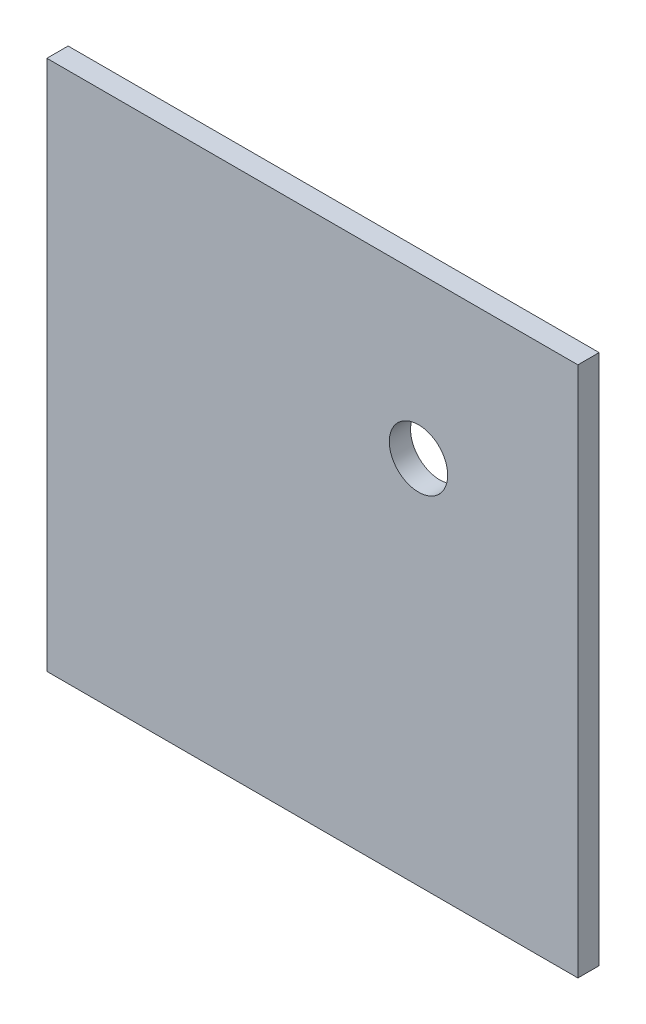
ISO-10303-21;
HEADER;
FILE_DESCRIPTION(('STEP AP214'),'2;1');
FILE_NAME('part.step','',(''),(''),'','','');
FILE_SCHEMA(('AUTOMOTIVE_DESIGN { 1 0 10303 214 1 1 1 1 }'));
ENDSEC;
DATA;
#1=APPLICATION_CONTEXT('core data for automotive mechanical design processes');
#2=APPLICATION_PROTOCOL_DEFINITION('international standard','automotive_design',2000,#1);
#3=PRODUCT_CONTEXT('',#1,'mechanical');
#4=PRODUCT('Part','Part','',(#3));
#5=PRODUCT_RELATED_PRODUCT_CATEGORY('part','',(#4));
#6=PRODUCT_DEFINITION_FORMATION('','',#4);
#7=PRODUCT_DEFINITION_CONTEXT('part definition',#1,'design');
#8=PRODUCT_DEFINITION('design','',#6,#7);
#9=PRODUCT_DEFINITION_SHAPE('','',#8);
#10=(LENGTH_UNIT() NAMED_UNIT(*) SI_UNIT(.MILLI.,.METRE.));
#11=(NAMED_UNIT(*) PLANE_ANGLE_UNIT() SI_UNIT($,.RADIAN.));
#12=(NAMED_UNIT(*) SI_UNIT($,.STERADIAN.) SOLID_ANGLE_UNIT());
#13=UNCERTAINTY_MEASURE_WITH_UNIT(LENGTH_MEASURE(1.E-05),#10,'distance_accuracy_value','');
#14=(GEOMETRIC_REPRESENTATION_CONTEXT(3) GLOBAL_UNCERTAINTY_ASSIGNED_CONTEXT((#13)) GLOBAL_UNIT_ASSIGNED_CONTEXT((#10,
#11,#12)) REPRESENTATION_CONTEXT('',''));
#15=CARTESIAN_POINT('',(0.,0.,0.));
#16=DIRECTION('',(0.,0.,1.));
#17=DIRECTION('',(1.,0.,0.));
#18=AXIS2_PLACEMENT_3D('',#15,#16,#17);
#19=CARTESIAN_POINT('',(50.,-50.,4.));
#20=DIRECTION('',(-1.,0.,0.));
#21=DIRECTION('',(0.,0.,1.));
#22=AXIS2_PLACEMENT_3D('',#19,#20,#21);
#23=PLANE('',#22);
#24=DIRECTION('',(0.,1.,0.));
#25=VECTOR('',#24,1.);
#26=CARTESIAN_POINT('',(50.,-50.,0.));
#27=LINE('',#26,#25);
#28=CARTESIAN_POINT('',(50.,-50.,0.));
#29=VERTEX_POINT('',#28);
#30=CARTESIAN_POINT('',(50.,50.,0.));
#31=VERTEX_POINT('',#30);
#32=EDGE_CURVE('E97',#29,#31,#27,.T.);
#33=ORIENTED_EDGE('',*,*,#32,.T.);
#34=DIRECTION('',(0.,0.,-1.));
#35=VECTOR('',#34,1.);
#36=CARTESIAN_POINT('',(50.,50.,4.));
#37=LINE('',#36,#35);
#38=CARTESIAN_POINT('',(50.,50.,4.));
#39=VERTEX_POINT('',#38);
#40=EDGE_CURVE('E11',#39,#31,#37,.T.);
#41=ORIENTED_EDGE('',*,*,#40,.F.);
#42=DIRECTION('',(0.,1.,0.));
#43=VECTOR('',#42,1.);
#44=CARTESIAN_POINT('',(50.,-50.,4.));
#45=LINE('',#44,#43);
#46=CARTESIAN_POINT('',(50.,-50.,4.));
#47=VERTEX_POINT('',#46);
#48=EDGE_CURVE('E85',#47,#39,#45,.T.);
#49=ORIENTED_EDGE('',*,*,#48,.F.);
#50=DIRECTION('',(0.,0.,-1.));
#51=VECTOR('',#50,1.);
#52=CARTESIAN_POINT('',(50.,-50.,4.));
#53=LINE('',#52,#51);
#54=EDGE_CURVE('E93',#47,#29,#53,.T.);
#55=ORIENTED_EDGE('',*,*,#54,.T.);
#56=EDGE_LOOP('',(#33,#41,#49,#55));
#57=FACE_BOUND('',#56,.T.);
#58=ADVANCED_FACE('F34',(#57),#23,.F.);
#59=CARTESIAN_POINT('',(-50.,50.,4.));
#60=DIRECTION('',(0.,-1.,0.));
#61=DIRECTION('',(0.,0.,-1.));
#62=AXIS2_PLACEMENT_3D('',#59,#60,#61);
#63=PLANE('',#62);
#64=DIRECTION('',(-1.,0.,0.));
#65=VECTOR('',#64,1.);
#66=CARTESIAN_POINT('',(-50.,50.,0.));
#67=LINE('',#66,#65);
#68=CARTESIAN_POINT('',(-50.,50.,0.));
#69=VERTEX_POINT('',#68);
#70=EDGE_CURVE('E89',#31,#69,#67,.T.);
#71=ORIENTED_EDGE('',*,*,#70,.T.);
#72=DIRECTION('',(0.,0.,-1.));
#73=VECTOR('',#72,1.);
#74=CARTESIAN_POINT('',(-50.,50.,4.));
#75=LINE('',#74,#73);
#76=CARTESIAN_POINT('',(-50.,50.,4.));
#77=VERTEX_POINT('',#76);
#78=EDGE_CURVE('E42',#77,#69,#75,.T.);
#79=ORIENTED_EDGE('',*,*,#78,.F.);
#80=DIRECTION('',(-1.,0.,0.));
#81=VECTOR('',#80,1.);
#82=CARTESIAN_POINT('',(-50.,50.,4.));
#83=LINE('',#82,#81);
#84=EDGE_CURVE('E80',#39,#77,#83,.T.);
#85=ORIENTED_EDGE('',*,*,#84,.F.);
#86=ORIENTED_EDGE('',*,*,#40,.T.);
#87=EDGE_LOOP('',(#71,#79,#85,#86));
#88=FACE_BOUND('',#87,.T.);
#89=ADVANCED_FACE('F88',(#88),#63,.F.);
#90=CARTESIAN_POINT('',(-50.,-50.,4.));
#91=DIRECTION('',(1.,0.,0.));
#92=DIRECTION('',(0.,0.,-1.));
#93=AXIS2_PLACEMENT_3D('',#90,#91,#92);
#94=PLANE('',#93);
#95=DIRECTION('',(0.,-1.,0.));
#96=VECTOR('',#95,1.);
#97=CARTESIAN_POINT('',(-50.,-50.,0.));
#98=LINE('',#97,#96);
#99=CARTESIAN_POINT('',(-50.,-50.,0.));
#100=VERTEX_POINT('',#99);
#101=EDGE_CURVE('E67',#69,#100,#98,.T.);
#102=ORIENTED_EDGE('',*,*,#101,.T.);
#103=DIRECTION('',(0.,0.,-1.));
#104=VECTOR('',#103,1.);
#105=CARTESIAN_POINT('',(-50.,-50.,4.));
#106=LINE('',#105,#104);
#107=CARTESIAN_POINT('',(-50.,-50.,4.));
#108=VERTEX_POINT('',#107);
#109=EDGE_CURVE('E90',#108,#100,#106,.T.);
#110=ORIENTED_EDGE('',*,*,#109,.F.);
#111=DIRECTION('',(0.,-1.,0.));
#112=VECTOR('',#111,1.);
#113=CARTESIAN_POINT('',(-50.,-50.,4.));
#114=LINE('',#113,#112);
#115=EDGE_CURVE('E83',#77,#108,#114,.T.);
#116=ORIENTED_EDGE('',*,*,#115,.F.);
#117=ORIENTED_EDGE('',*,*,#78,.T.);
#118=EDGE_LOOP('',(#102,#110,#116,#117));
#119=FACE_BOUND('',#118,.T.);
#120=ADVANCED_FACE('F91',(#119),#94,.F.);
#121=CARTESIAN_POINT('',(-50.,-50.,4.));
#122=DIRECTION('',(0.,1.,0.));
#123=DIRECTION('',(0.,0.,1.));
#124=AXIS2_PLACEMENT_3D('',#121,#122,#123);
#125=PLANE('',#124);
#126=DIRECTION('',(1.,0.,0.));
#127=VECTOR('',#126,1.);
#128=CARTESIAN_POINT('',(-50.,-50.,0.));
#129=LINE('',#128,#127);
#130=EDGE_CURVE('E73',#100,#29,#129,.T.);
#131=ORIENTED_EDGE('',*,*,#130,.T.);
#132=ORIENTED_EDGE('',*,*,#54,.F.);
#133=DIRECTION('',(1.,0.,0.));
#134=VECTOR('',#133,1.);
#135=CARTESIAN_POINT('',(-50.,-50.,4.));
#136=LINE('',#135,#134);
#137=EDGE_CURVE('E50',#108,#47,#136,.T.);
#138=ORIENTED_EDGE('',*,*,#137,.F.);
#139=ORIENTED_EDGE('',*,*,#109,.T.);
#140=EDGE_LOOP('',(#131,#132,#138,#139));
#141=FACE_BOUND('',#140,.T.);
#142=ADVANCED_FACE('F105',(#141),#125,.F.);
#143=CARTESIAN_POINT('',(0.,0.,4.));
#144=DIRECTION('',(0.,0.,-1.));
#145=DIRECTION('',(-1.,0.,0.));
#146=AXIS2_PLACEMENT_3D('',#143,#144,#145);
#147=PLANE('',#146);
#148=CARTESIAN_POINT('',(19.9832422219013,19.7310085100067,4.));
#149=DIRECTION('',(0.,0.,1.));
#150=DIRECTION('',(1.,0.,0.));
#151=AXIS2_PLACEMENT_3D('',#148,#149,#150);
#152=CIRCLE('',#151,5.5);
#153=CARTESIAN_POINT('',(25.4832422219013,19.7310085100067,4.));
#154=VERTEX_POINT('',#153);
#155=EDGE_CURVE('E135',#154,#154,#152,.T.);
#156=ORIENTED_EDGE('',*,*,#155,.F.);
#157=EDGE_LOOP('',(#156));
#158=FACE_BOUND('',#157,.T.);
#159=ORIENTED_EDGE('',*,*,#48,.T.);
#160=ORIENTED_EDGE('',*,*,#84,.T.);
#161=ORIENTED_EDGE('',*,*,#115,.T.);
#162=ORIENTED_EDGE('',*,*,#137,.T.);
#163=EDGE_LOOP('',(#159,#160,#161,#162));
#164=FACE_BOUND('',#163,.T.);
#165=ADVANCED_FACE('F81',(#158,#164),#147,.F.);
#166=CARTESIAN_POINT('',(0.,0.,0.));
#167=DIRECTION('',(0.,0.,-1.));
#168=DIRECTION('',(-1.,0.,0.));
#169=AXIS2_PLACEMENT_3D('',#166,#167,#168);
#170=PLANE('',#169);
#171=CARTESIAN_POINT('',(19.9832422219013,19.7310085100067,0.));
#172=DIRECTION('',(0.,0.,1.));
#173=DIRECTION('',(1.,0.,0.));
#174=AXIS2_PLACEMENT_3D('',#171,#172,#173);
#175=CIRCLE('',#174,5.5);
#176=CARTESIAN_POINT('',(25.4832422219013,19.7310085100067,0.));
#177=VERTEX_POINT('',#176);
#178=EDGE_CURVE('E121',#177,#177,#175,.T.);
#179=ORIENTED_EDGE('',*,*,#178,.T.);
#180=EDGE_LOOP('',(#179));
#181=FACE_BOUND('',#180,.T.);
#182=CARTESIAN_POINT('',(-45.,-45.,0.));
#183=DIRECTION('',(0.,0.,-1.));
#184=DIRECTION('',(-1.,0.,0.));
#185=AXIS2_PLACEMENT_3D('',#182,#183,#184);
#186=CIRCLE('',#185,4.75);
#187=CARTESIAN_POINT('',(-49.75,-45.,0.));
#188=VERTEX_POINT('',#187);
#189=EDGE_CURVE('E130',#188,#188,#186,.T.);
#190=ORIENTED_EDGE('',*,*,#189,.F.);
#191=EDGE_LOOP('',(#190));
#192=FACE_BOUND('',#191,.T.);
#193=CARTESIAN_POINT('',(45.,-45.,0.));
#194=DIRECTION('',(0.,0.,-1.));
#195=DIRECTION('',(-1.,0.,0.));
#196=AXIS2_PLACEMENT_3D('',#193,#194,#195);
#197=CIRCLE('',#196,4.75);
#198=CARTESIAN_POINT('',(40.25,-45.,0.));
#199=VERTEX_POINT('',#198);
#200=EDGE_CURVE('E124',#199,#199,#197,.T.);
#201=ORIENTED_EDGE('',*,*,#200,.F.);
#202=EDGE_LOOP('',(#201));
#203=FACE_BOUND('',#202,.T.);
#204=CARTESIAN_POINT('',(45.,45.,0.));
#205=DIRECTION('',(0.,0.,-1.));
#206=DIRECTION('',(-1.,0.,0.));
#207=AXIS2_PLACEMENT_3D('',#204,#205,#206);
#208=CIRCLE('',#207,4.75);
#209=CARTESIAN_POINT('',(40.25,45.,0.));
#210=VERTEX_POINT('',#209);
#211=EDGE_CURVE('E117',#210,#210,#208,.T.);
#212=ORIENTED_EDGE('',*,*,#211,.F.);
#213=EDGE_LOOP('',(#212));
#214=FACE_BOUND('',#213,.T.);
#215=CARTESIAN_POINT('',(-45.,45.,0.));
#216=DIRECTION('',(0.,0.,-1.));
#217=DIRECTION('',(-1.,0.,0.));
#218=AXIS2_PLACEMENT_3D('',#215,#216,#217);
#219=CIRCLE('',#218,4.75);
#220=CARTESIAN_POINT('',(-49.75,45.,0.));
#221=VERTEX_POINT('',#220);
#222=EDGE_CURVE('E111',#221,#221,#219,.T.);
#223=ORIENTED_EDGE('',*,*,#222,.F.);
#224=EDGE_LOOP('',(#223));
#225=FACE_BOUND('',#224,.T.);
#226=ORIENTED_EDGE('',*,*,#32,.F.);
#227=ORIENTED_EDGE('',*,*,#130,.F.);
#228=ORIENTED_EDGE('',*,*,#101,.F.);
#229=ORIENTED_EDGE('',*,*,#70,.F.);
#230=EDGE_LOOP('',(#226,#227,#228,#229));
#231=FACE_BOUND('',#230,.T.);
#232=ADVANCED_FACE('F108',(#181,#192,#203,#214,#225,#231),#170,.T.);
#233=CARTESIAN_POINT('',(-45.,45.,2.));
#234=DIRECTION('',(0.,0.,-1.));
#235=DIRECTION('',(-1.,0.,0.));
#236=AXIS2_PLACEMENT_3D('',#233,#234,#235);
#237=CYLINDRICAL_SURFACE('',#236,4.75);
#238=CARTESIAN_POINT('',(-45.,45.,2.));
#239=DIRECTION('',(0.,0.,-1.));
#240=DIRECTION('',(-1.,0.,0.));
#241=AXIS2_PLACEMENT_3D('',#238,#239,#240);
#242=CIRCLE('',#241,4.75);
#243=CARTESIAN_POINT('',(-49.75,45.,2.));
#244=VERTEX_POINT('',#243);
#245=EDGE_CURVE('E100',#244,#244,#242,.T.);
#246=ORIENTED_EDGE('',*,*,#245,.F.);
#247=EDGE_LOOP('',(#246));
#248=FACE_BOUND('',#247,.T.);
#249=ORIENTED_EDGE('',*,*,#222,.T.);
#250=EDGE_LOOP('',(#249));
#251=FACE_BOUND('',#250,.T.);
#252=ADVANCED_FACE('F156',(#248,#251),#237,.F.);
#253=CARTESIAN_POINT('',(-45.,45.,2.));
#254=DIRECTION('',(0.,0.,-1.));
#255=DIRECTION('',(-1.,0.,0.));
#256=AXIS2_PLACEMENT_3D('',#253,#254,#255);
#257=PLANE('',#256);
#258=ORIENTED_EDGE('',*,*,#245,.T.);
#259=EDGE_LOOP('',(#258));
#260=FACE_BOUND('',#259,.T.);
#261=ADVANCED_FACE('F184',(#260),#257,.T.);
#262=CARTESIAN_POINT('',(45.,45.,2.));
#263=DIRECTION('',(0.,0.,-1.));
#264=DIRECTION('',(-1.,0.,0.));
#265=AXIS2_PLACEMENT_3D('',#262,#263,#264);
#266=CYLINDRICAL_SURFACE('',#265,4.75);
#267=CARTESIAN_POINT('',(45.,45.,2.));
#268=DIRECTION('',(0.,0.,-1.));
#269=DIRECTION('',(-1.,0.,0.));
#270=AXIS2_PLACEMENT_3D('',#267,#268,#269);
#271=CIRCLE('',#270,4.75);
#272=CARTESIAN_POINT('',(40.25,45.,2.));
#273=VERTEX_POINT('',#272);
#274=EDGE_CURVE('E120',#273,#273,#271,.T.);
#275=ORIENTED_EDGE('',*,*,#274,.F.);
#276=EDGE_LOOP('',(#275));
#277=FACE_BOUND('',#276,.T.);
#278=ORIENTED_EDGE('',*,*,#211,.T.);
#279=EDGE_LOOP('',(#278));
#280=FACE_BOUND('',#279,.T.);
#281=ADVANCED_FACE('F194',(#277,#280),#266,.F.);
#282=CARTESIAN_POINT('',(45.,45.,2.));
#283=DIRECTION('',(0.,0.,-1.));
#284=DIRECTION('',(-1.,0.,0.));
#285=AXIS2_PLACEMENT_3D('',#282,#283,#284);
#286=PLANE('',#285);
#287=ORIENTED_EDGE('',*,*,#274,.T.);
#288=EDGE_LOOP('',(#287));
#289=FACE_BOUND('',#288,.T.);
#290=ADVANCED_FACE('F204',(#289),#286,.T.);
#291=CARTESIAN_POINT('',(45.,-45.,2.));
#292=DIRECTION('',(0.,0.,-1.));
#293=DIRECTION('',(-1.,0.,0.));
#294=AXIS2_PLACEMENT_3D('',#291,#292,#293);
#295=CYLINDRICAL_SURFACE('',#294,4.75);
#296=CARTESIAN_POINT('',(45.,-45.,2.));
#297=DIRECTION('',(0.,0.,-1.));
#298=DIRECTION('',(-1.,0.,0.));
#299=AXIS2_PLACEMENT_3D('',#296,#297,#298);
#300=CIRCLE('',#299,4.75);
#301=CARTESIAN_POINT('',(40.25,-45.,2.));
#302=VERTEX_POINT('',#301);
#303=EDGE_CURVE('E127',#302,#302,#300,.T.);
#304=ORIENTED_EDGE('',*,*,#303,.F.);
#305=EDGE_LOOP('',(#304));
#306=FACE_BOUND('',#305,.T.);
#307=ORIENTED_EDGE('',*,*,#200,.T.);
#308=EDGE_LOOP('',(#307));
#309=FACE_BOUND('',#308,.T.);
#310=ADVANCED_FACE('F214',(#306,#309),#295,.F.);
#311=CARTESIAN_POINT('',(45.,-45.,2.));
#312=DIRECTION('',(0.,0.,-1.));
#313=DIRECTION('',(-1.,0.,0.));
#314=AXIS2_PLACEMENT_3D('',#311,#312,#313);
#315=PLANE('',#314);
#316=ORIENTED_EDGE('',*,*,#303,.T.);
#317=EDGE_LOOP('',(#316));
#318=FACE_BOUND('',#317,.T.);
#319=ADVANCED_FACE('F224',(#318),#315,.T.);
#320=CARTESIAN_POINT('',(-45.,-45.,2.));
#321=DIRECTION('',(0.,0.,-1.));
#322=DIRECTION('',(-1.,0.,0.));
#323=AXIS2_PLACEMENT_3D('',#320,#321,#322);
#324=CYLINDRICAL_SURFACE('',#323,4.75);
#325=CARTESIAN_POINT('',(-45.,-45.,2.));
#326=DIRECTION('',(0.,0.,-1.));
#327=DIRECTION('',(-1.,0.,0.));
#328=AXIS2_PLACEMENT_3D('',#325,#326,#327);
#329=CIRCLE('',#328,4.75);
#330=CARTESIAN_POINT('',(-49.75,-45.,2.));
#331=VERTEX_POINT('',#330);
#332=EDGE_CURVE('E114',#331,#331,#329,.T.);
#333=ORIENTED_EDGE('',*,*,#332,.F.);
#334=EDGE_LOOP('',(#333));
#335=FACE_BOUND('',#334,.T.);
#336=ORIENTED_EDGE('',*,*,#189,.T.);
#337=EDGE_LOOP('',(#336));
#338=FACE_BOUND('',#337,.T.);
#339=ADVANCED_FACE('F234',(#335,#338),#324,.F.);
#340=CARTESIAN_POINT('',(-45.,-45.,2.));
#341=DIRECTION('',(0.,0.,-1.));
#342=DIRECTION('',(-1.,0.,0.));
#343=AXIS2_PLACEMENT_3D('',#340,#341,#342);
#344=PLANE('',#343);
#345=ORIENTED_EDGE('',*,*,#332,.T.);
#346=EDGE_LOOP('',(#345));
#347=FACE_BOUND('',#346,.T.);
#348=ADVANCED_FACE('F146',(#347),#344,.T.);
#349=CARTESIAN_POINT('',(19.9832422219013,19.7310085100067,0.));
#350=DIRECTION('',(0.,0.,1.));
#351=DIRECTION('',(1.,0.,0.));
#352=AXIS2_PLACEMENT_3D('',#349,#350,#351);
#353=CYLINDRICAL_SURFACE('',#352,5.5);
#354=ORIENTED_EDGE('',*,*,#178,.F.);
#355=EDGE_LOOP('',(#354));
#356=FACE_BOUND('',#355,.T.);
#357=ORIENTED_EDGE('',*,*,#155,.T.);
#358=EDGE_LOOP('',(#357));
#359=FACE_BOUND('',#358,.T.);
#360=ADVANCED_FACE('F143',(#356,#359),#353,.F.);
#361=CLOSED_SHELL('',(#58,#89,#120,#142,#165,#232,#252,#261,#281,#290,#310,#319,#339,#348,#360));
#362=MANIFOLD_SOLID_BREP('B2',#361);
#363=ADVANCED_BREP_SHAPE_REPRESENTATION('',(#18,#362),#14);
#364=SHAPE_DEFINITION_REPRESENTATION(#9,#363);
ENDSEC;
END-ISO-10303-21;
